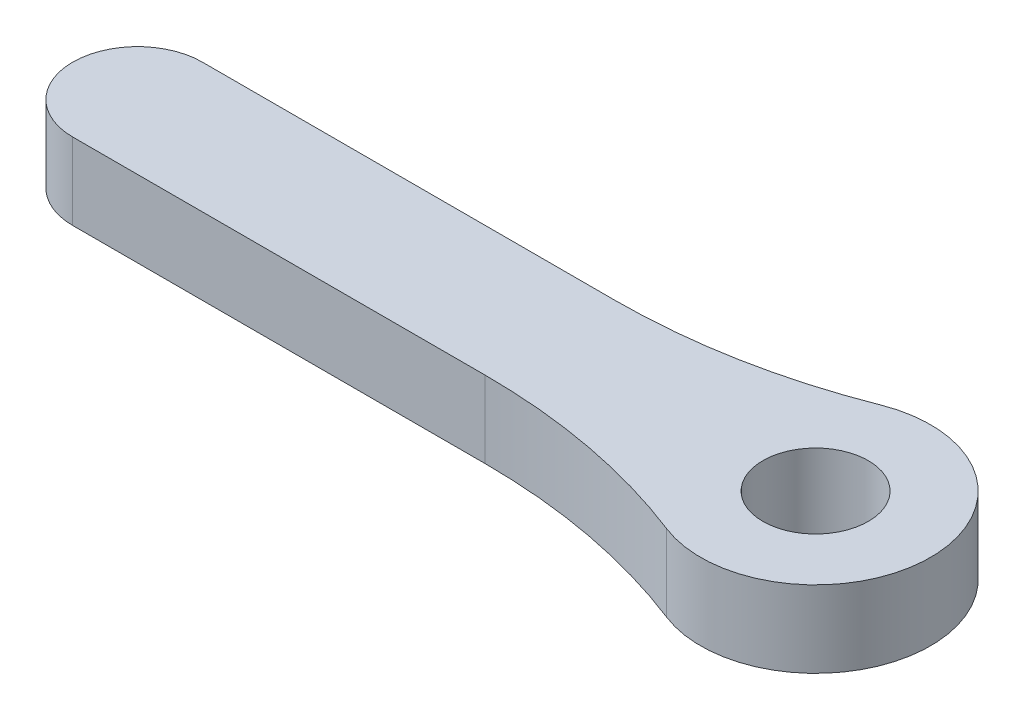
ISO-10303-21;
HEADER;
FILE_DESCRIPTION(('STEP AP214'),'2;1');
FILE_NAME('part.step','',(''),(''),'','','');
FILE_SCHEMA(('AUTOMOTIVE_DESIGN { 1 0 10303 214 1 1 1 1 }'));
ENDSEC;
DATA;
#1=APPLICATION_CONTEXT('core data for automotive mechanical design processes');
#2=APPLICATION_PROTOCOL_DEFINITION('international standard','automotive_design',2000,#1);
#3=PRODUCT_CONTEXT('',#1,'mechanical');
#4=PRODUCT('Part','Part','',(#3));
#5=PRODUCT_RELATED_PRODUCT_CATEGORY('part','',(#4));
#6=PRODUCT_DEFINITION_FORMATION('','',#4);
#7=PRODUCT_DEFINITION_CONTEXT('part definition',#1,'design');
#8=PRODUCT_DEFINITION('design','',#6,#7);
#9=PRODUCT_DEFINITION_SHAPE('','',#8);
#10=(LENGTH_UNIT() NAMED_UNIT(*) SI_UNIT(.MILLI.,.METRE.));
#11=(NAMED_UNIT(*) PLANE_ANGLE_UNIT() SI_UNIT($,.RADIAN.));
#12=(NAMED_UNIT(*) SI_UNIT($,.STERADIAN.) SOLID_ANGLE_UNIT());
#13=UNCERTAINTY_MEASURE_WITH_UNIT(LENGTH_MEASURE(1.E-05),#10,'distance_accuracy_value','');
#14=(GEOMETRIC_REPRESENTATION_CONTEXT(3) GLOBAL_UNCERTAINTY_ASSIGNED_CONTEXT((#13)) GLOBAL_UNIT_ASSIGNED_CONTEXT((#10,
#11,#12)) REPRESENTATION_CONTEXT('',''));
#15=CARTESIAN_POINT('',(0.,0.,0.));
#16=DIRECTION('',(0.,0.,1.));
#17=DIRECTION('',(1.,0.,0.));
#18=AXIS2_PLACEMENT_3D('',#15,#16,#17);
#19=CARTESIAN_POINT('',(-3.93288641788489,3.175,2.6858538072681));
#20=DIRECTION('',(0.,0.,-1.));
#21=DIRECTION('',(-1.,0.,0.));
#22=AXIS2_PLACEMENT_3D('',#19,#20,#21);
#23=PLANE('',#22);
#24=DIRECTION('',(1.,0.,0.));
#25=VECTOR('',#24,1.);
#26=CARTESIAN_POINT('',(-3.93288641788489,0.,2.6858538072681));
#27=LINE('',#26,#25);
#28=CARTESIAN_POINT('',(-28.0858538072681,0.,2.6858538072681));
#29=VERTEX_POINT('',#28);
#30=CARTESIAN_POINT('',(-10.998237229973,0.,2.6858538072681));
#31=VERTEX_POINT('',#30);
#32=EDGE_CURVE('E115',#29,#31,#27,.T.);
#33=ORIENTED_EDGE('',*,*,#32,.T.);
#34=DIRECTION('',(0.,1.,0.));
#35=VECTOR('',#34,1.);
#36=CARTESIAN_POINT('',(-10.998237229973,3.175,2.6858538072681));
#37=LINE('',#36,#35);
#38=CARTESIAN_POINT('',(-10.998237229973,3.175,2.68585380726809));
#39=VERTEX_POINT('',#38);
#40=EDGE_CURVE('E48',#31,#39,#37,.T.);
#41=ORIENTED_EDGE('',*,*,#40,.T.);
#42=DIRECTION('',(1.,0.,0.));
#43=VECTOR('',#42,1.);
#44=CARTESIAN_POINT('',(-28.0858538072681,3.175,2.6858538072681));
#45=LINE('',#44,#43);
#46=CARTESIAN_POINT('',(-28.0858538072681,3.175,2.6858538072681));
#47=VERTEX_POINT('',#46);
#48=EDGE_CURVE('E123',#47,#39,#45,.T.);
#49=ORIENTED_EDGE('',*,*,#48,.F.);
#50=DIRECTION('',(0.,-1.,0.));
#51=VECTOR('',#50,1.);
#52=CARTESIAN_POINT('',(-28.0858538072681,3.175,2.6858538072681));
#53=LINE('',#52,#51);
#54=EDGE_CURVE('E107',#47,#29,#53,.T.);
#55=ORIENTED_EDGE('',*,*,#54,.T.);
#56=EDGE_LOOP('',(#33,#41,#49,#55));
#57=FACE_BOUND('',#56,.T.);
#58=ADVANCED_FACE('F33',(#57),#23,.F.);
#59=CARTESIAN_POINT('',(0.,3.175,0.));
#60=DIRECTION('',(0.,-1.,0.));
#61=DIRECTION('',(0.,0.,-1.));
#62=AXIS2_PLACEMENT_3D('',#59,#60,#61);
#63=CYLINDRICAL_SURFACE('',#62,4.7625);
#64=CARTESIAN_POINT('',(0.,0.,0.));
#65=DIRECTION('',(0.,1.,0.));
#66=DIRECTION('',(0.,0.,1.));
#67=AXIS2_PLACEMENT_3D('',#64,#65,#66);
#68=CIRCLE('',#67,4.7625);
#69=CARTESIAN_POINT('',(-1.73656377315363,0.,4.43460849588444));
#70=VERTEX_POINT('',#69);
#71=CARTESIAN_POINT('',(-1.73656377315365,0.,-4.43460849588443));
#72=VERTEX_POINT('',#71);
#73=EDGE_CURVE('E117',#70,#72,#68,.T.);
#74=ORIENTED_EDGE('',*,*,#73,.T.);
#75=DIRECTION('',(0.,-1.,0.));
#76=VECTOR('',#75,1.);
#77=CARTESIAN_POINT('',(-1.73656377315365,3.175,-4.43460849588443));
#78=LINE('',#77,#76);
#79=CARTESIAN_POINT('',(-1.73656377315365,3.175,-4.43460849588443));
#80=VERTEX_POINT('',#79);
#81=EDGE_CURVE('E129',#72,#80,#78,.F.);
#82=ORIENTED_EDGE('',*,*,#81,.T.);
#83=CARTESIAN_POINT('',(0.,3.175,0.));
#84=DIRECTION('',(0.,1.,0.));
#85=DIRECTION('',(0.,0.,1.));
#86=AXIS2_PLACEMENT_3D('',#83,#84,#85);
#87=CIRCLE('',#86,4.7625);
#88=CARTESIAN_POINT('',(-1.73656377315363,3.175,4.43460849588444));
#89=VERTEX_POINT('',#88);
#90=EDGE_CURVE('E96',#89,#80,#87,.T.);
#91=ORIENTED_EDGE('',*,*,#90,.F.);
#92=DIRECTION('',(0.,-1.,0.));
#93=VECTOR('',#92,1.);
#94=CARTESIAN_POINT('',(-1.73656377315363,3.175,4.43460849588444));
#95=LINE('',#94,#93);
#96=EDGE_CURVE('E126',#89,#70,#95,.T.);
#97=ORIENTED_EDGE('',*,*,#96,.T.);
#98=EDGE_LOOP('',(#74,#82,#91,#97));
#99=FACE_BOUND('',#98,.T.);
#100=ADVANCED_FACE('F138',(#99),#63,.T.);
#101=CARTESIAN_POINT('',(-25.4,3.175,-2.6858538072681));
#102=DIRECTION('',(0.,0.,1.));
#103=DIRECTION('',(1.,0.,0.));
#104=AXIS2_PLACEMENT_3D('',#101,#102,#103);
#105=PLANE('',#104);
#106=DIRECTION('',(-1.,0.,0.));
#107=VECTOR('',#106,1.);
#108=CARTESIAN_POINT('',(-3.93288641788489,3.175,-2.6858538072681));
#109=LINE('',#108,#107);
#110=CARTESIAN_POINT('',(-10.9982372299732,3.175,-2.6858538072681));
#111=VERTEX_POINT('',#110);
#112=CARTESIAN_POINT('',(-28.0858538072681,3.175,-2.6858538072681));
#113=VERTEX_POINT('',#112);
#114=EDGE_CURVE('E84',#111,#113,#109,.T.);
#115=ORIENTED_EDGE('',*,*,#114,.F.);
#116=DIRECTION('',(0.,1.,0.));
#117=VECTOR('',#116,1.);
#118=CARTESIAN_POINT('',(-10.9982372299732,0.,-2.68585380726805));
#119=LINE('',#118,#117);
#120=CARTESIAN_POINT('',(-10.9982372299732,0.,-2.68585380726805));
#121=VERTEX_POINT('',#120);
#122=EDGE_CURVE('E106',#111,#121,#119,.F.);
#123=ORIENTED_EDGE('',*,*,#122,.T.);
#124=DIRECTION('',(-1.,0.,0.));
#125=VECTOR('',#124,1.);
#126=CARTESIAN_POINT('',(-25.4,0.,-2.6858538072681));
#127=LINE('',#126,#125);
#128=CARTESIAN_POINT('',(-28.0858538072681,0.,-2.6858538072681));
#129=VERTEX_POINT('',#128);
#130=EDGE_CURVE('E102',#121,#129,#127,.T.);
#131=ORIENTED_EDGE('',*,*,#130,.T.);
#132=DIRECTION('',(0.,-1.,0.));
#133=VECTOR('',#132,1.);
#134=CARTESIAN_POINT('',(-28.0858538072681,3.175,-2.6858538072681));
#135=LINE('',#134,#133);
#136=EDGE_CURVE('E99',#113,#129,#135,.T.);
#137=ORIENTED_EDGE('',*,*,#136,.F.);
#138=EDGE_LOOP('',(#115,#123,#131,#137));
#139=FACE_BOUND('',#138,.T.);
#140=ADVANCED_FACE('F100',(#139),#105,.F.);
#141=CARTESIAN_POINT('',(-28.0858538072681,3.175,0.));
#142=DIRECTION('',(0.,-1.,0.));
#143=DIRECTION('',(0.,0.,-1.));
#144=AXIS2_PLACEMENT_3D('',#141,#142,#143);
#145=CYLINDRICAL_SURFACE('',#144,2.6858538072681);
#146=CARTESIAN_POINT('',(-28.0858538072681,0.,0.));
#147=DIRECTION('',(0.,1.,0.));
#148=DIRECTION('',(0.,0.,1.));
#149=AXIS2_PLACEMENT_3D('',#146,#147,#148);
#150=CIRCLE('',#149,2.6858538072681);
#151=EDGE_CURVE('E122',#129,#29,#150,.T.);
#152=ORIENTED_EDGE('',*,*,#151,.T.);
#153=ORIENTED_EDGE('',*,*,#54,.F.);
#154=CARTESIAN_POINT('',(-28.0858538072681,3.175,0.));
#155=DIRECTION('',(0.,1.,0.));
#156=DIRECTION('',(0.,0.,1.));
#157=AXIS2_PLACEMENT_3D('',#154,#155,#156);
#158=CIRCLE('',#157,2.6858538072681);
#159=EDGE_CURVE('E88',#113,#47,#158,.T.);
#160=ORIENTED_EDGE('',*,*,#159,.F.);
#161=ORIENTED_EDGE('',*,*,#136,.T.);
#162=EDGE_LOOP('',(#152,#153,#160,#161));
#163=FACE_BOUND('',#162,.T.);
#164=ADVANCED_FACE('F109',(#163),#145,.T.);
#165=CARTESIAN_POINT('',(0.,3.175,0.));
#166=DIRECTION('',(0.,1.,0.));
#167=DIRECTION('',(0.,0.,1.));
#168=AXIS2_PLACEMENT_3D('',#165,#166,#167);
#169=PLANE('',#168);
#170=CARTESIAN_POINT('',(0.,3.175,0.));
#171=DIRECTION('',(0.,1.,0.));
#172=DIRECTION('',(0.,0.,1.));
#173=AXIS2_PLACEMENT_3D('',#170,#171,#172);
#174=CIRCLE('',#173,2.18287599999999);
#175=CARTESIAN_POINT('',(0.,3.175,2.18287599999999));
#176=VERTEX_POINT('',#175);
#177=EDGE_CURVE('E171',#176,#176,#174,.T.);
#178=ORIENTED_EDGE('',*,*,#177,.F.);
#179=EDGE_LOOP('',(#178));
#180=FACE_BOUND('',#179,.T.);
#181=ORIENTED_EDGE('',*,*,#48,.T.);
#182=CARTESIAN_POINT('',(-10.998237229973,3.175,28.0858538072681));
#183=DIRECTION('',(0.,1.,0.));
#184=DIRECTION('',(0.,0.,1.));
#185=AXIS2_PLACEMENT_3D('',#182,#183,#184);
#186=CIRCLE('',#185,25.4);
#187=EDGE_CURVE('E11',#39,#89,#186,.F.);
#188=ORIENTED_EDGE('',*,*,#187,.T.);
#189=ORIENTED_EDGE('',*,*,#90,.T.);
#190=CARTESIAN_POINT('',(-10.9982372299731,3.175,-28.0858538072681));
#191=DIRECTION('',(0.,1.,0.));
#192=DIRECTION('',(0.,0.,1.));
#193=AXIS2_PLACEMENT_3D('',#190,#191,#192);
#194=CIRCLE('',#193,25.4);
#195=EDGE_CURVE('E92',#80,#111,#194,.F.);
#196=ORIENTED_EDGE('',*,*,#195,.T.);
#197=ORIENTED_EDGE('',*,*,#114,.T.);
#198=ORIENTED_EDGE('',*,*,#159,.T.);
#199=EDGE_LOOP('',(#181,#188,#189,#196,#197,#198));
#200=FACE_BOUND('',#199,.T.);
#201=ADVANCED_FACE('F86',(#180,#200),#169,.T.);
#202=CARTESIAN_POINT('',(0.,0.,0.));
#203=DIRECTION('',(0.,1.,0.));
#204=DIRECTION('',(0.,0.,1.));
#205=AXIS2_PLACEMENT_3D('',#202,#203,#204);
#206=PLANE('',#205);
#207=CARTESIAN_POINT('',(0.,0.,0.));
#208=DIRECTION('',(0.,1.,0.));
#209=DIRECTION('',(0.,0.,1.));
#210=AXIS2_PLACEMENT_3D('',#207,#208,#209);
#211=CIRCLE('',#210,2.182876);
#212=CARTESIAN_POINT('',(0.,0.,2.182876));
#213=VERTEX_POINT('',#212);
#214=EDGE_CURVE('E118',#213,#213,#211,.T.);
#215=ORIENTED_EDGE('',*,*,#214,.T.);
#216=EDGE_LOOP('',(#215));
#217=FACE_BOUND('',#216,.T.);
#218=ORIENTED_EDGE('',*,*,#32,.F.);
#219=ORIENTED_EDGE('',*,*,#151,.F.);
#220=ORIENTED_EDGE('',*,*,#130,.F.);
#221=CARTESIAN_POINT('',(-10.9982372299731,0.,-28.0858538072681));
#222=DIRECTION('',(0.,1.,0.));
#223=DIRECTION('',(0.,0.,1.));
#224=AXIS2_PLACEMENT_3D('',#221,#222,#223);
#225=CIRCLE('',#224,25.4);
#226=EDGE_CURVE('E132',#121,#72,#225,.T.);
#227=ORIENTED_EDGE('',*,*,#226,.T.);
#228=ORIENTED_EDGE('',*,*,#73,.F.);
#229=CARTESIAN_POINT('',(-10.998237229973,0.,28.0858538072681));
#230=DIRECTION('',(0.,1.,0.));
#231=DIRECTION('',(0.,0.,1.));
#232=AXIS2_PLACEMENT_3D('',#229,#230,#231);
#233=CIRCLE('',#232,25.4);
#234=EDGE_CURVE('E41',#70,#31,#233,.T.);
#235=ORIENTED_EDGE('',*,*,#234,.T.);
#236=EDGE_LOOP('',(#218,#219,#220,#227,#228,#235));
#237=FACE_BOUND('',#236,.T.);
#238=ADVANCED_FACE('F134',(#217,#237),#206,.F.);
#239=CARTESIAN_POINT('',(0.,3.175,0.));
#240=DIRECTION('',(0.,1.,0.));
#241=DIRECTION('',(0.,0.,1.));
#242=AXIS2_PLACEMENT_3D('',#239,#240,#241);
#243=CYLINDRICAL_SURFACE('',#242,2.18287599999999);
#244=ORIENTED_EDGE('',*,*,#214,.F.);
#245=EDGE_LOOP('',(#244));
#246=FACE_BOUND('',#245,.T.);
#247=ORIENTED_EDGE('',*,*,#177,.T.);
#248=EDGE_LOOP('',(#247));
#249=FACE_BOUND('',#248,.T.);
#250=ADVANCED_FACE('F143',(#246,#249),#243,.F.);
#251=CARTESIAN_POINT('',(-10.9982372299731,3.175,-28.0858538072681));
#252=DIRECTION('',(0.,-1.,0.));
#253=DIRECTION('',(0.,0.,-1.));
#254=AXIS2_PLACEMENT_3D('',#251,#252,#253);
#255=CYLINDRICAL_SURFACE('',#254,25.4);
#256=ORIENTED_EDGE('',*,*,#195,.F.);
#257=ORIENTED_EDGE('',*,*,#81,.F.);
#258=ORIENTED_EDGE('',*,*,#226,.F.);
#259=ORIENTED_EDGE('',*,*,#122,.F.);
#260=EDGE_LOOP('',(#256,#257,#258,#259));
#261=FACE_BOUND('',#260,.T.);
#262=ADVANCED_FACE('F141',(#261),#255,.F.);
#263=CARTESIAN_POINT('',(-10.998237229973,3.175,28.0858538072681));
#264=DIRECTION('',(0.,-1.,0.));
#265=DIRECTION('',(0.,0.,-1.));
#266=AXIS2_PLACEMENT_3D('',#263,#264,#265);
#267=CYLINDRICAL_SURFACE('',#266,25.4);
#268=ORIENTED_EDGE('',*,*,#187,.F.);
#269=ORIENTED_EDGE('',*,*,#40,.F.);
#270=ORIENTED_EDGE('',*,*,#234,.F.);
#271=ORIENTED_EDGE('',*,*,#96,.F.);
#272=EDGE_LOOP('',(#268,#269,#270,#271));
#273=FACE_BOUND('',#272,.T.);
#274=ADVANCED_FACE('F35',(#273),#267,.F.);
#275=CLOSED_SHELL('',(#58,#100,#140,#164,#201,#238,#250,#262,#274));
#276=MANIFOLD_SOLID_BREP('B2',#275);
#277=ADVANCED_BREP_SHAPE_REPRESENTATION('',(#18,#276),#14);
#278=SHAPE_DEFINITION_REPRESENTATION(#9,#277);
ENDSEC;
END-ISO-10303-21;
